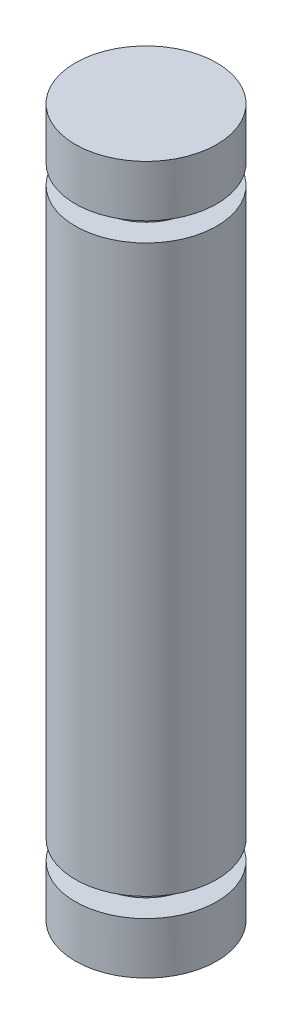
ISO-10303-21;
HEADER;
FILE_DESCRIPTION(('STEP AP214'),'2;1');
FILE_NAME('part.step','',(''),(''),'','','');
FILE_SCHEMA(('AUTOMOTIVE_DESIGN { 1 0 10303 214 1 1 1 1 }'));
ENDSEC;
DATA;
#1=APPLICATION_CONTEXT('core data for automotive mechanical design processes');
#2=APPLICATION_PROTOCOL_DEFINITION('international standard','automotive_design',2000,#1);
#3=PRODUCT_CONTEXT('',#1,'mechanical');
#4=PRODUCT('Part','Part','',(#3));
#5=PRODUCT_RELATED_PRODUCT_CATEGORY('part','',(#4));
#6=PRODUCT_DEFINITION_FORMATION('','',#4);
#7=PRODUCT_DEFINITION_CONTEXT('part definition',#1,'design');
#8=PRODUCT_DEFINITION('design','',#6,#7);
#9=PRODUCT_DEFINITION_SHAPE('','',#8);
#10=(LENGTH_UNIT() NAMED_UNIT(*) SI_UNIT(.MILLI.,.METRE.));
#11=(NAMED_UNIT(*) PLANE_ANGLE_UNIT() SI_UNIT($,.RADIAN.));
#12=(NAMED_UNIT(*) SI_UNIT($,.STERADIAN.) SOLID_ANGLE_UNIT());
#13=UNCERTAINTY_MEASURE_WITH_UNIT(LENGTH_MEASURE(1.E-05),#10,'distance_accuracy_value','');
#14=(GEOMETRIC_REPRESENTATION_CONTEXT(3) GLOBAL_UNCERTAINTY_ASSIGNED_CONTEXT((#13)) GLOBAL_UNIT_ASSIGNED_CONTEXT((#10,
#11,#12)) REPRESENTATION_CONTEXT('',''));
#15=CARTESIAN_POINT('',(0.,0.,0.));
#16=DIRECTION('',(0.,0.,1.));
#17=DIRECTION('',(1.,0.,0.));
#18=AXIS2_PLACEMENT_3D('',#15,#16,#17);
#19=CARTESIAN_POINT('',(0.,25.,0.));
#20=DIRECTION('',(0.,-1.,0.));
#21=DIRECTION('',(0.,0.,-1.));
#22=AXIS2_PLACEMENT_3D('',#19,#20,#21);
#23=CYLINDRICAL_SURFACE('',#22,2.5);
#24=CARTESIAN_POINT('',(0.,0.,0.));
#25=DIRECTION('',(0.,1.,0.));
#26=DIRECTION('',(0.,0.,1.));
#27=AXIS2_PLACEMENT_3D('',#24,#25,#26);
#28=CIRCLE('',#27,2.5);
#29=CARTESIAN_POINT('',(0.,0.,2.5));
#30=VERTEX_POINT('',#29);
#31=EDGE_CURVE('E35',#30,#30,#28,.T.);
#32=ORIENTED_EDGE('',*,*,#31,.T.);
#33=EDGE_LOOP('',(#32));
#34=FACE_BOUND('',#33,.T.);
#35=CARTESIAN_POINT('',(0.,1.82,0.));
#36=DIRECTION('',(0.,-1.,0.));
#37=DIRECTION('',(0.,0.,-1.));
#38=AXIS2_PLACEMENT_3D('',#35,#36,#37);
#39=CIRCLE('',#38,2.5);
#40=CARTESIAN_POINT('',(0.,1.82,-2.5));
#41=VERTEX_POINT('',#40);
#42=EDGE_CURVE('E42',#41,#41,#39,.T.);
#43=ORIENTED_EDGE('',*,*,#42,.T.);
#44=EDGE_LOOP('',(#43));
#45=FACE_BOUND('',#44,.T.);
#46=ADVANCED_FACE('F32',(#34,#45),#23,.T.);
#47=CARTESIAN_POINT('',(0.,0.,0.));
#48=DIRECTION('',(0.,1.,0.));
#49=DIRECTION('',(0.,0.,1.));
#50=AXIS2_PLACEMENT_3D('',#47,#48,#49);
#51=PLANE('',#50);
#52=ORIENTED_EDGE('',*,*,#31,.F.);
#53=EDGE_LOOP('',(#52));
#54=FACE_BOUND('',#53,.T.);
#55=ADVANCED_FACE('F89',(#54),#51,.F.);
#56=CARTESIAN_POINT('',(0.,1.82,2.5));
#57=DIRECTION('',(0.,1.,0.));
#58=DIRECTION('',(0.,0.,1.));
#59=AXIS2_PLACEMENT_3D('',#56,#57,#58);
#60=PLANE('',#59);
#61=CARTESIAN_POINT('',(0.,1.82,0.));
#62=DIRECTION('',(0.,-1.,0.));
#63=DIRECTION('',(0.,0.,-1.));
#64=AXIS2_PLACEMENT_3D('',#61,#62,#63);
#65=CIRCLE('',#64,1.6);
#66=CARTESIAN_POINT('',(0.,1.82,-1.6));
#67=VERTEX_POINT('',#66);
#68=EDGE_CURVE('E59',#67,#67,#65,.T.);
#69=ORIENTED_EDGE('',*,*,#68,.T.);
#70=EDGE_LOOP('',(#69));
#71=FACE_BOUND('',#70,.T.);
#72=ORIENTED_EDGE('',*,*,#42,.F.);
#73=EDGE_LOOP('',(#72));
#74=FACE_BOUND('',#73,.T.);
#75=ADVANCED_FACE('F94',(#71,#74),#60,.T.);
#76=CARTESIAN_POINT('',(0.,0.,0.));
#77=DIRECTION('',(0.,-1.,0.));
#78=DIRECTION('',(0.,0.,-1.));
#79=AXIS2_PLACEMENT_3D('',#76,#77,#78);
#80=CYLINDRICAL_SURFACE('',#79,1.6);
#81=CARTESIAN_POINT('',(0.,2.5,0.));
#82=DIRECTION('',(0.,-1.,0.));
#83=DIRECTION('',(0.,0.,-1.));
#84=AXIS2_PLACEMENT_3D('',#81,#82,#83);
#85=CIRCLE('',#84,1.6);
#86=CARTESIAN_POINT('',(0.,2.5,-1.6));
#87=VERTEX_POINT('',#86);
#88=EDGE_CURVE('E62',#87,#87,#85,.T.);
#89=ORIENTED_EDGE('',*,*,#88,.T.);
#90=EDGE_LOOP('',(#89));
#91=FACE_BOUND('',#90,.T.);
#92=ORIENTED_EDGE('',*,*,#68,.F.);
#93=EDGE_LOOP('',(#92));
#94=FACE_BOUND('',#93,.T.);
#95=ADVANCED_FACE('F83',(#91,#94),#80,.T.);
#96=CARTESIAN_POINT('',(0.,2.5,1.6));
#97=DIRECTION('',(0.,-1.,0.));
#98=DIRECTION('',(0.,0.,-1.));
#99=AXIS2_PLACEMENT_3D('',#96,#97,#98);
#100=PLANE('',#99);
#101=CARTESIAN_POINT('',(0.,2.5,0.));
#102=DIRECTION('',(0.,-1.,0.));
#103=DIRECTION('',(0.,0.,-1.));
#104=AXIS2_PLACEMENT_3D('',#101,#102,#103);
#105=CIRCLE('',#104,2.5);
#106=CARTESIAN_POINT('',(0.,2.5,-2.5));
#107=VERTEX_POINT('',#106);
#108=EDGE_CURVE('E47',#107,#107,#105,.T.);
#109=ORIENTED_EDGE('',*,*,#108,.T.);
#110=EDGE_LOOP('',(#109));
#111=FACE_BOUND('',#110,.T.);
#112=ORIENTED_EDGE('',*,*,#88,.F.);
#113=EDGE_LOOP('',(#112));
#114=FACE_BOUND('',#113,.T.);
#115=ADVANCED_FACE('F68',(#111,#114),#100,.T.);
#116=CARTESIAN_POINT('',(0.,22.5,0.));
#117=DIRECTION('',(0.,-1.,0.));
#118=DIRECTION('',(0.,0.,-1.));
#119=AXIS2_PLACEMENT_3D('',#116,#117,#118);
#120=CIRCLE('',#119,2.5);
#121=CARTESIAN_POINT('',(0.,22.5,-2.5));
#122=VERTEX_POINT('',#121);
#123=EDGE_CURVE('E51',#122,#122,#120,.T.);
#124=ORIENTED_EDGE('',*,*,#123,.T.);
#125=EDGE_LOOP('',(#124));
#126=FACE_BOUND('',#125,.T.);
#127=ORIENTED_EDGE('',*,*,#108,.F.);
#128=EDGE_LOOP('',(#127));
#129=FACE_BOUND('',#128,.T.);
#130=ADVANCED_FACE('F71',(#126,#129),#23,.T.);
#131=CARTESIAN_POINT('',(0.,23.18,2.5));
#132=DIRECTION('',(0.,-1.,0.));
#133=DIRECTION('',(0.,0.,-1.));
#134=AXIS2_PLACEMENT_3D('',#131,#132,#133);
#135=PLANE('',#134);
#136=CARTESIAN_POINT('',(0.,23.18,0.));
#137=DIRECTION('',(0.,-1.,0.));
#138=DIRECTION('',(0.,0.,-1.));
#139=AXIS2_PLACEMENT_3D('',#136,#137,#138);
#140=CIRCLE('',#139,2.5);
#141=CARTESIAN_POINT('',(0.,23.18,-2.5));
#142=VERTEX_POINT('',#141);
#143=EDGE_CURVE('E54',#142,#142,#140,.T.);
#144=ORIENTED_EDGE('',*,*,#143,.T.);
#145=EDGE_LOOP('',(#144));
#146=FACE_BOUND('',#145,.T.);
#147=CARTESIAN_POINT('',(0.,23.18,0.));
#148=DIRECTION('',(0.,-1.,0.));
#149=DIRECTION('',(0.,0.,-1.));
#150=AXIS2_PLACEMENT_3D('',#147,#148,#149);
#151=CIRCLE('',#150,1.6);
#152=CARTESIAN_POINT('',(0.,23.18,-1.6));
#153=VERTEX_POINT('',#152);
#154=EDGE_CURVE('E44',#153,#153,#151,.T.);
#155=ORIENTED_EDGE('',*,*,#154,.F.);
#156=EDGE_LOOP('',(#155));
#157=FACE_BOUND('',#156,.T.);
#158=ADVANCED_FACE('F73',(#146,#157),#135,.T.);
#159=CARTESIAN_POINT('',(0.,0.,0.));
#160=DIRECTION('',(0.,-1.,0.));
#161=DIRECTION('',(0.,0.,-1.));
#162=AXIS2_PLACEMENT_3D('',#159,#160,#161);
#163=CYLINDRICAL_SURFACE('',#162,1.6);
#164=ORIENTED_EDGE('',*,*,#154,.T.);
#165=EDGE_LOOP('',(#164));
#166=FACE_BOUND('',#165,.T.);
#167=CARTESIAN_POINT('',(0.,22.5,0.));
#168=DIRECTION('',(0.,-1.,0.));
#169=DIRECTION('',(0.,0.,-1.));
#170=AXIS2_PLACEMENT_3D('',#167,#168,#169);
#171=CIRCLE('',#170,1.6);
#172=CARTESIAN_POINT('',(0.,22.5,-1.6));
#173=VERTEX_POINT('',#172);
#174=EDGE_CURVE('E48',#173,#173,#171,.T.);
#175=ORIENTED_EDGE('',*,*,#174,.F.);
#176=EDGE_LOOP('',(#175));
#177=FACE_BOUND('',#176,.T.);
#178=ADVANCED_FACE('F80',(#166,#177),#163,.T.);
#179=CARTESIAN_POINT('',(0.,22.5,1.6));
#180=DIRECTION('',(0.,1.,0.));
#181=DIRECTION('',(0.,0.,1.));
#182=AXIS2_PLACEMENT_3D('',#179,#180,#181);
#183=PLANE('',#182);
#184=ORIENTED_EDGE('',*,*,#174,.T.);
#185=EDGE_LOOP('',(#184));
#186=FACE_BOUND('',#185,.T.);
#187=ORIENTED_EDGE('',*,*,#123,.F.);
#188=EDGE_LOOP('',(#187));
#189=FACE_BOUND('',#188,.T.);
#190=ADVANCED_FACE('F109',(#186,#189),#183,.T.);
#191=CARTESIAN_POINT('',(0.,25.,0.));
#192=DIRECTION('',(0.,1.,0.));
#193=DIRECTION('',(0.,0.,1.));
#194=AXIS2_PLACEMENT_3D('',#191,#192,#193);
#195=PLANE('',#194);
#196=CARTESIAN_POINT('',(0.,25.,0.));
#197=DIRECTION('',(0.,1.,0.));
#198=DIRECTION('',(0.,0.,1.));
#199=AXIS2_PLACEMENT_3D('',#196,#197,#198);
#200=CIRCLE('',#199,2.5);
#201=CARTESIAN_POINT('',(0.,25.,2.5));
#202=VERTEX_POINT('',#201);
#203=EDGE_CURVE('E10',#202,#202,#200,.T.);
#204=ORIENTED_EDGE('',*,*,#203,.T.);
#205=EDGE_LOOP('',(#204));
#206=FACE_BOUND('',#205,.T.);
#207=ADVANCED_FACE('F86',(#206),#195,.T.);
#208=ORIENTED_EDGE('',*,*,#203,.F.);
#209=EDGE_LOOP('',(#208));
#210=FACE_BOUND('',#209,.T.);
#211=ORIENTED_EDGE('',*,*,#143,.F.);
#212=EDGE_LOOP('',(#211));
#213=FACE_BOUND('',#212,.T.);
#214=ADVANCED_FACE('F75',(#210,#213),#23,.T.);
#215=CLOSED_SHELL('',(#46,#55,#75,#95,#115,#130,#158,#178,#190,#207,#214));
#216=MANIFOLD_SOLID_BREP('B2',#215);
#217=ADVANCED_BREP_SHAPE_REPRESENTATION('',(#18,#216),#14);
#218=SHAPE_DEFINITION_REPRESENTATION(#9,#217);
ENDSEC;
END-ISO-10303-21;
